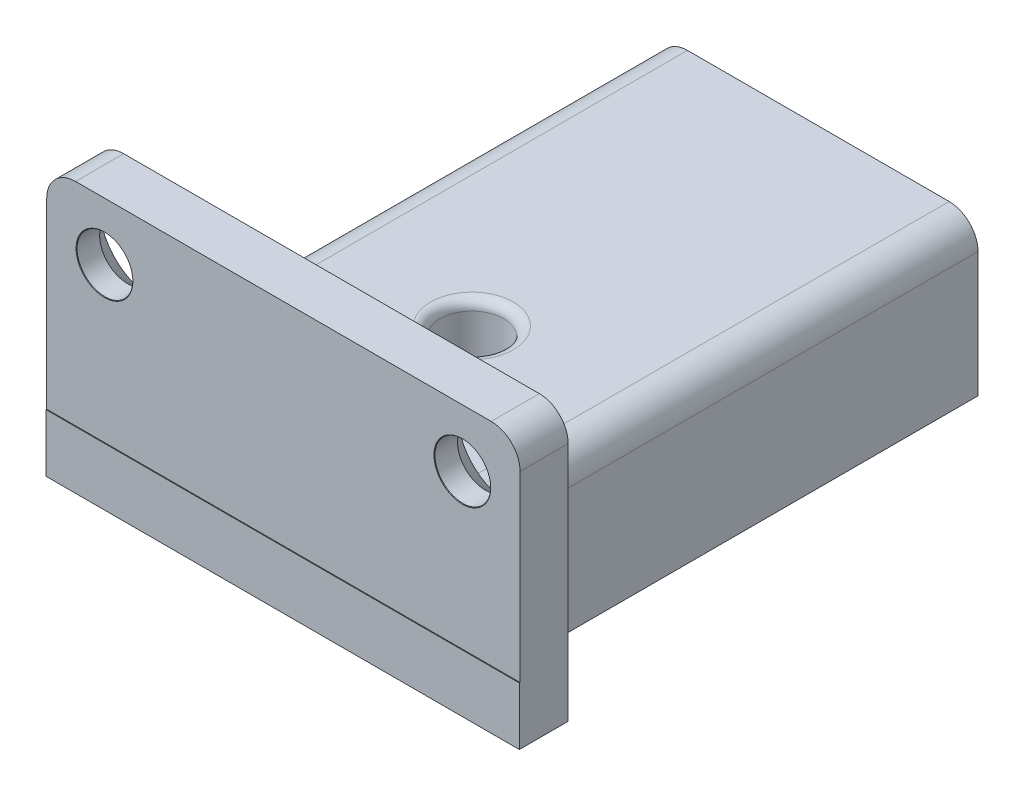
ISO-10303-21;
HEADER;
FILE_DESCRIPTION(('STEP AP214'),'2;1');
FILE_NAME('part.step','',(''),(''),'','','');
FILE_SCHEMA(('AUTOMOTIVE_DESIGN { 1 0 10303 214 1 1 1 1 }'));
ENDSEC;
DATA;
#1=APPLICATION_CONTEXT('core data for automotive mechanical design processes');
#2=APPLICATION_PROTOCOL_DEFINITION('international standard','automotive_design',2000,#1);
#3=PRODUCT_CONTEXT('',#1,'mechanical');
#4=PRODUCT('Part','Part','',(#3));
#5=PRODUCT_RELATED_PRODUCT_CATEGORY('part','',(#4));
#6=PRODUCT_DEFINITION_FORMATION('','',#4);
#7=PRODUCT_DEFINITION_CONTEXT('part definition',#1,'design');
#8=PRODUCT_DEFINITION('design','',#6,#7);
#9=PRODUCT_DEFINITION_SHAPE('','',#8);
#10=(LENGTH_UNIT() NAMED_UNIT(*) SI_UNIT(.MILLI.,.METRE.));
#11=(NAMED_UNIT(*) PLANE_ANGLE_UNIT() SI_UNIT($,.RADIAN.));
#12=(NAMED_UNIT(*) SI_UNIT($,.STERADIAN.) SOLID_ANGLE_UNIT());
#13=UNCERTAINTY_MEASURE_WITH_UNIT(LENGTH_MEASURE(1.E-05),#10,'distance_accuracy_value','');
#14=(GEOMETRIC_REPRESENTATION_CONTEXT(3) GLOBAL_UNCERTAINTY_ASSIGNED_CONTEXT((#13)) GLOBAL_UNIT_ASSIGNED_CONTEXT((#10,
#11,#12)) REPRESENTATION_CONTEXT('',''));
#15=CARTESIAN_POINT('',(0.,0.,0.));
#16=DIRECTION('',(0.,0.,1.));
#17=DIRECTION('',(1.,0.,0.));
#18=AXIS2_PLACEMENT_3D('',#15,#16,#17);
#19=CARTESIAN_POINT('',(-12.3,0.,5.33820224719101));
#20=DIRECTION('',(0.,0.,-1.));
#21=DIRECTION('',(-1.,0.,0.));
#22=AXIS2_PLACEMENT_3D('',#19,#20,#21);
#23=PLANE('',#22);
#24=DIRECTION('',(1.,0.,0.));
#25=VECTOR('',#24,1.);
#26=CARTESIAN_POINT('',(12.3,-3.,5.33820224719101));
#27=LINE('',#26,#25);
#28=CARTESIAN_POINT('',(-7.29999999999999,-3.,5.33820224719101));
#29=VERTEX_POINT('',#28);
#30=CARTESIAN_POINT('',(7.3,-3.,5.33820224719101));
#31=VERTEX_POINT('',#30);
#32=EDGE_CURVE('E273',#29,#31,#27,.T.);
#33=ORIENTED_EDGE('',*,*,#32,.F.);
#34=CARTESIAN_POINT('',(-7.3,-2.,5.33820224719101));
#35=DIRECTION('',(0.,0.,-1.));
#36=DIRECTION('',(-1.,0.,0.));
#37=AXIS2_PLACEMENT_3D('',#34,#35,#36);
#38=CIRCLE('',#37,1.);
#39=CARTESIAN_POINT('',(-6.3,-2.,5.33820224719101));
#40=VERTEX_POINT('',#39);
#41=EDGE_CURVE('E410',#29,#40,#38,.F.);
#42=ORIENTED_EDGE('',*,*,#41,.T.);
#43=DIRECTION('',(0.,-1.,0.));
#44=VECTOR('',#43,1.);
#45=CARTESIAN_POINT('',(-6.3,5.,5.33820224719101));
#46=LINE('',#45,#44);
#47=CARTESIAN_POINT('',(-6.3,0.,5.33820224719101));
#48=VERTEX_POINT('',#47);
#49=EDGE_CURVE('E240',#48,#40,#46,.T.);
#50=ORIENTED_EDGE('',*,*,#49,.F.);
#51=DIRECTION('',(1.,0.,0.));
#52=VECTOR('',#51,1.);
#53=CARTESIAN_POINT('',(12.3,0.,5.33820224719101));
#54=LINE('',#53,#52);
#55=CARTESIAN_POINT('',(6.3,0.,5.33820224719101));
#56=VERTEX_POINT('',#55);
#57=EDGE_CURVE('E266',#48,#56,#54,.T.);
#58=ORIENTED_EDGE('',*,*,#57,.T.);
#59=DIRECTION('',(0.,1.,0.));
#60=VECTOR('',#59,1.);
#61=CARTESIAN_POINT('',(6.3,5.,5.33820224719101));
#62=LINE('',#61,#60);
#63=CARTESIAN_POINT('',(6.3,-2.,5.33820224719101));
#64=VERTEX_POINT('',#63);
#65=EDGE_CURVE('E248',#64,#56,#62,.T.);
#66=ORIENTED_EDGE('',*,*,#65,.F.);
#67=CARTESIAN_POINT('',(7.3,-2.,5.33820224719101));
#68=DIRECTION('',(0.,0.,-1.));
#69=DIRECTION('',(-1.,0.,0.));
#70=AXIS2_PLACEMENT_3D('',#67,#68,#69);
#71=CIRCLE('',#70,1.);
#72=EDGE_CURVE('E412',#64,#31,#71,.F.);
#73=ORIENTED_EDGE('',*,*,#72,.T.);
#74=EDGE_LOOP('',(#33,#42,#50,#58,#66,#73));
#75=FACE_BOUND('',#74,.T.);
#76=ADVANCED_FACE('F36',(#75),#23,.T.);
#77=CARTESIAN_POINT('',(-9.3,8.,5.33820224719101));
#78=DIRECTION('',(0.,0.,-1.));
#79=DIRECTION('',(-1.,0.,0.));
#80=AXIS2_PLACEMENT_3D('',#77,#78,#79);
#81=CIRCLE('',#80,2.75);
#82=CARTESIAN_POINT('',(-12.05,8.,5.33820224719101));
#83=VERTEX_POINT('',#82);
#84=EDGE_CURVE('E308',#83,#83,#81,.T.);
#85=ORIENTED_EDGE('',*,*,#84,.F.);
#86=EDGE_LOOP('',(#85));
#87=FACE_BOUND('',#86,.T.);
#88=CARTESIAN_POINT('',(9.3,8.,5.33820224719101));
#89=DIRECTION('',(0.,0.,-1.));
#90=DIRECTION('',(-1.,0.,0.));
#91=AXIS2_PLACEMENT_3D('',#88,#89,#90);
#92=CIRCLE('',#91,2.75);
#93=CARTESIAN_POINT('',(6.55,8.,5.33820224719101));
#94=VERTEX_POINT('',#93);
#95=EDGE_CURVE('E320',#94,#94,#92,.T.);
#96=ORIENTED_EDGE('',*,*,#95,.F.);
#97=EDGE_LOOP('',(#96));
#98=FACE_BOUND('',#97,.T.);
#99=DIRECTION('',(-1.,0.,0.));
#100=VECTOR('',#99,1.);
#101=CARTESIAN_POINT('',(-12.3,11.,5.33820224719101));
#102=LINE('',#101,#100);
#103=CARTESIAN_POINT('',(10.8,11.,5.33820224719101));
#104=VERTEX_POINT('',#103);
#105=CARTESIAN_POINT('',(-10.8,11.,5.33820224719101));
#106=VERTEX_POINT('',#105);
#107=EDGE_CURVE('E332',#104,#106,#102,.T.);
#108=ORIENTED_EDGE('',*,*,#107,.F.);
#109=CARTESIAN_POINT('',(10.8,9.5,5.33820224719101));
#110=DIRECTION('',(0.,0.,-1.));
#111=DIRECTION('',(-1.,0.,0.));
#112=AXIS2_PLACEMENT_3D('',#109,#110,#111);
#113=CIRCLE('',#112,1.5);
#114=CARTESIAN_POINT('',(12.3,9.5,5.33820224719101));
#115=VERTEX_POINT('',#114);
#116=EDGE_CURVE('E440',#104,#115,#113,.T.);
#117=ORIENTED_EDGE('',*,*,#116,.T.);
#118=DIRECTION('',(0.,1.,0.));
#119=VECTOR('',#118,1.);
#120=CARTESIAN_POINT('',(12.3,0.,5.33820224719101));
#121=LINE('',#120,#119);
#122=CARTESIAN_POINT('',(12.3,-3.,5.33820224719101));
#123=VERTEX_POINT('',#122);
#124=EDGE_CURVE('E340',#123,#115,#121,.T.);
#125=ORIENTED_EDGE('',*,*,#124,.F.);
#126=CARTESIAN_POINT('',(8.3,-3.,5.33820224719101));
#127=VERTEX_POINT('',#126);
#128=EDGE_CURVE('E270',#127,#123,#27,.T.);
#129=ORIENTED_EDGE('',*,*,#128,.F.);
#130=DIRECTION('',(0.,-1.,0.));
#131=VECTOR('',#130,1.);
#132=CARTESIAN_POINT('',(8.3,5.,5.33820224719101));
#133=LINE('',#132,#131);
#134=CARTESIAN_POINT('',(8.3,3.5,5.33820224719101));
#135=VERTEX_POINT('',#134);
#136=EDGE_CURVE('E232',#135,#127,#133,.T.);
#137=ORIENTED_EDGE('',*,*,#136,.F.);
#138=CARTESIAN_POINT('',(6.8,3.5,5.33820224719101));
#139=DIRECTION('',(0.,0.,-1.));
#140=DIRECTION('',(-1.,0.,0.));
#141=AXIS2_PLACEMENT_3D('',#138,#139,#140);
#142=CIRCLE('',#141,1.5);
#143=CARTESIAN_POINT('',(6.8,5.,5.33820224719101));
#144=VERTEX_POINT('',#143);
#145=EDGE_CURVE('E430',#135,#144,#142,.F.);
#146=ORIENTED_EDGE('',*,*,#145,.T.);
#147=DIRECTION('',(-1.,0.,0.));
#148=VECTOR('',#147,1.);
#149=CARTESIAN_POINT('',(0.,5.,5.33820224719101));
#150=LINE('',#149,#148);
#151=CARTESIAN_POINT('',(-6.8,5.,5.33820224719101));
#152=VERTEX_POINT('',#151);
#153=EDGE_CURVE('E339',#144,#152,#150,.T.);
#154=ORIENTED_EDGE('',*,*,#153,.T.);
#155=CARTESIAN_POINT('',(-6.8,3.5,5.33820224719101));
#156=DIRECTION('',(0.,0.,-1.));
#157=DIRECTION('',(-1.,0.,0.));
#158=AXIS2_PLACEMENT_3D('',#155,#156,#157);
#159=CIRCLE('',#158,1.5);
#160=CARTESIAN_POINT('',(-8.3,3.5,5.33820224719101));
#161=VERTEX_POINT('',#160);
#162=EDGE_CURVE('E428',#152,#161,#159,.F.);
#163=ORIENTED_EDGE('',*,*,#162,.T.);
#164=DIRECTION('',(0.,1.,0.));
#165=VECTOR('',#164,1.);
#166=CARTESIAN_POINT('',(-8.3,5.,5.33820224719101));
#167=LINE('',#166,#165);
#168=CARTESIAN_POINT('',(-8.3,-3.,5.33820224719101));
#169=VERTEX_POINT('',#168);
#170=EDGE_CURVE('E239',#169,#161,#167,.T.);
#171=ORIENTED_EDGE('',*,*,#170,.F.);
#172=CARTESIAN_POINT('',(-12.3,-3.,5.33820224719101));
#173=VERTEX_POINT('',#172);
#174=EDGE_CURVE('E238',#173,#169,#27,.T.);
#175=ORIENTED_EDGE('',*,*,#174,.F.);
#176=DIRECTION('',(0.,1.,0.));
#177=VECTOR('',#176,1.);
#178=CARTESIAN_POINT('',(-12.3,0.,5.33820224719101));
#179=LINE('',#178,#177);
#180=CARTESIAN_POINT('',(-12.3,9.5,5.33820224719101));
#181=VERTEX_POINT('',#180);
#182=EDGE_CURVE('E336',#173,#181,#179,.T.);
#183=ORIENTED_EDGE('',*,*,#182,.T.);
#184=CARTESIAN_POINT('',(-10.8,9.5,5.33820224719101));
#185=DIRECTION('',(0.,0.,-1.));
#186=DIRECTION('',(-1.,0.,0.));
#187=AXIS2_PLACEMENT_3D('',#184,#185,#186);
#188=CIRCLE('',#187,1.5);
#189=EDGE_CURVE('E438',#181,#106,#188,.T.);
#190=ORIENTED_EDGE('',*,*,#189,.T.);
#191=EDGE_LOOP('',(#108,#117,#125,#129,#137,#146,#154,#163,#171,#175,#183,#190));
#192=FACE_BOUND('',#191,.T.);
#193=ADVANCED_FACE('F454',(#87,#98,#192),#23,.T.);
#194=CARTESIAN_POINT('',(0.,0.,0.));
#195=DIRECTION('',(0.,1.,0.));
#196=DIRECTION('',(0.,0.,1.));
#197=AXIS2_PLACEMENT_3D('',#194,#195,#196);
#198=PLANE('',#197);
#199=CARTESIAN_POINT('',(0.,0.,-1.96179775280899));
#200=DIRECTION('',(0.,1.,0.));
#201=DIRECTION('',(0.,0.,1.));
#202=AXIS2_PLACEMENT_3D('',#199,#200,#201);
#203=CIRCLE('',#202,2.15);
#204=CARTESIAN_POINT('',(0.,0.,0.188202247191008));
#205=VERTEX_POINT('',#204);
#206=EDGE_CURVE('E362',#205,#205,#203,.T.);
#207=ORIENTED_EDGE('',*,*,#206,.T.);
#208=EDGE_LOOP('',(#207));
#209=FACE_BOUND('',#208,.T.);
#210=ORIENTED_EDGE('',*,*,#57,.F.);
#211=DIRECTION('',(0.,0.,1.));
#212=VECTOR('',#211,1.);
#213=CARTESIAN_POINT('',(-6.3,0.,-4.96179775280899));
#214=LINE('',#213,#212);
#215=CARTESIAN_POINT('',(-6.3,0.,-4.96179775280899));
#216=VERTEX_POINT('',#215);
#217=EDGE_CURVE('E347',#216,#48,#214,.T.);
#218=ORIENTED_EDGE('',*,*,#217,.F.);
#219=DIRECTION('',(-1.,0.,0.));
#220=VECTOR('',#219,1.);
#221=CARTESIAN_POINT('',(-6.3,0.,-4.96179775280899));
#222=LINE('',#221,#220);
#223=CARTESIAN_POINT('',(6.3,0.,-4.96179775280899));
#224=VERTEX_POINT('',#223);
#225=EDGE_CURVE('E355',#224,#216,#222,.T.);
#226=ORIENTED_EDGE('',*,*,#225,.F.);
#227=DIRECTION('',(0.,0.,-1.));
#228=VECTOR('',#227,1.);
#229=CARTESIAN_POINT('',(6.3,0.,-4.96179775280899));
#230=LINE('',#229,#228);
#231=EDGE_CURVE('E352',#56,#224,#230,.T.);
#232=ORIENTED_EDGE('',*,*,#231,.F.);
#233=EDGE_LOOP('',(#210,#218,#226,#232));
#234=FACE_BOUND('',#233,.T.);
#235=ADVANCED_FACE('F492',(#209,#234),#198,.F.);
#236=CARTESIAN_POINT('',(-6.3,5.,-4.96179775280899));
#237=DIRECTION('',(0.,0.,1.));
#238=DIRECTION('',(1.,0.,0.));
#239=AXIS2_PLACEMENT_3D('',#236,#237,#238);
#240=PLANE('',#239);
#241=DIRECTION('',(0.,-1.,0.));
#242=VECTOR('',#241,1.);
#243=CARTESIAN_POINT('',(-6.3,5.,-4.96179775280899));
#244=LINE('',#243,#242);
#245=CARTESIAN_POINT('',(-6.3,1.,-4.96179775280899));
#246=VERTEX_POINT('',#245);
#247=EDGE_CURVE('E358',#246,#216,#244,.T.);
#248=ORIENTED_EDGE('',*,*,#247,.F.);
#249=DIRECTION('',(-1.,0.,0.));
#250=VECTOR('',#249,1.);
#251=CARTESIAN_POINT('',(6.3,0.999999999999998,-4.96179775280899));
#252=LINE('',#251,#250);
#253=CARTESIAN_POINT('',(6.3,0.999999999999998,-4.96179775280899));
#254=VERTEX_POINT('',#253);
#255=EDGE_CURVE('E390',#246,#254,#252,.F.);
#256=ORIENTED_EDGE('',*,*,#255,.T.);
#257=DIRECTION('',(0.,-1.,0.));
#258=VECTOR('',#257,1.);
#259=CARTESIAN_POINT('',(6.3,5.,-4.96179775280899));
#260=LINE('',#259,#258);
#261=EDGE_CURVE('E360',#254,#224,#260,.T.);
#262=ORIENTED_EDGE('',*,*,#261,.T.);
#263=ORIENTED_EDGE('',*,*,#225,.T.);
#264=EDGE_LOOP('',(#248,#256,#262,#263));
#265=FACE_BOUND('',#264,.T.);
#266=ADVANCED_FACE('F544',(#265),#240,.F.);
#267=CARTESIAN_POINT('',(0.,5.,0.));
#268=DIRECTION('',(0.,1.,0.));
#269=DIRECTION('',(0.,0.,1.));
#270=AXIS2_PLACEMENT_3D('',#267,#268,#269);
#271=PLANE('',#270);
#272=CARTESIAN_POINT('',(0.,5.,-1.96179775280899));
#273=DIRECTION('',(0.,1.,0.));
#274=DIRECTION('',(0.,0.,1.));
#275=AXIS2_PLACEMENT_3D('',#272,#273,#274);
#276=CIRCLE('',#275,2.15);
#277=CARTESIAN_POINT('',(0.,5.,0.188202247191008));
#278=VERTEX_POINT('',#277);
#279=EDGE_CURVE('E371',#278,#278,#276,.F.);
#280=ORIENTED_EDGE('',*,*,#279,.T.);
#281=EDGE_LOOP('',(#280));
#282=FACE_BOUND('',#281,.T.);
#283=DIRECTION('',(1.,0.,0.));
#284=VECTOR('',#283,1.);
#285=CARTESIAN_POINT('',(6.3,5.,-19.961797752809));
#286=LINE('',#285,#284);
#287=CARTESIAN_POINT('',(-6.8,5.,-19.961797752809));
#288=VERTEX_POINT('',#287);
#289=CARTESIAN_POINT('',(6.8,5.,-19.961797752809));
#290=VERTEX_POINT('',#289);
#291=EDGE_CURVE('E290',#288,#290,#286,.T.);
#292=ORIENTED_EDGE('',*,*,#291,.F.);
#293=DIRECTION('',(0.,0.,1.));
#294=VECTOR('',#293,1.);
#295=CARTESIAN_POINT('',(-6.8,5.,5.33820224719101));
#296=LINE('',#295,#294);
#297=EDGE_CURVE('E417',#288,#152,#296,.T.);
#298=ORIENTED_EDGE('',*,*,#297,.T.);
#299=ORIENTED_EDGE('',*,*,#153,.F.);
#300=DIRECTION('',(0.,0.,1.));
#301=VECTOR('',#300,1.);
#302=CARTESIAN_POINT('',(6.8,5.,-19.961797752809));
#303=LINE('',#302,#301);
#304=EDGE_CURVE('E415',#144,#290,#303,.F.);
#305=ORIENTED_EDGE('',*,*,#304,.T.);
#306=EDGE_LOOP('',(#292,#298,#299,#305));
#307=FACE_BOUND('',#306,.T.);
#308=ADVANCED_FACE('F541',(#282,#307),#271,.T.);
#309=CARTESIAN_POINT('',(-6.3,5.,7.83820224719101));
#310=DIRECTION('',(0.,0.,-1.));
#311=DIRECTION('',(-1.,0.,0.));
#312=AXIS2_PLACEMENT_3D('',#309,#310,#311);
#313=PLANE('',#312);
#314=CARTESIAN_POINT('',(-9.3,8.,7.83820224719101));
#315=DIRECTION('',(0.,0.,-1.));
#316=DIRECTION('',(-1.,0.,0.));
#317=AXIS2_PLACEMENT_3D('',#314,#315,#316);
#318=CIRCLE('',#317,1.475);
#319=CARTESIAN_POINT('',(-10.775,8.,7.83820224719101));
#320=VERTEX_POINT('',#319);
#321=EDGE_CURVE('E305',#320,#320,#318,.T.);
#322=ORIENTED_EDGE('',*,*,#321,.T.);
#323=EDGE_LOOP('',(#322));
#324=FACE_BOUND('',#323,.T.);
#325=CARTESIAN_POINT('',(9.3,8.,7.83820224719101));
#326=DIRECTION('',(0.,0.,-1.));
#327=DIRECTION('',(-1.,0.,0.));
#328=AXIS2_PLACEMENT_3D('',#325,#326,#327);
#329=CIRCLE('',#328,1.475);
#330=CARTESIAN_POINT('',(7.825,8.,7.83820224719101));
#331=VERTEX_POINT('',#330);
#332=EDGE_CURVE('E317',#331,#331,#329,.T.);
#333=ORIENTED_EDGE('',*,*,#332,.T.);
#334=EDGE_LOOP('',(#333));
#335=FACE_BOUND('',#334,.T.);
#336=DIRECTION('',(0.,1.,0.));
#337=VECTOR('',#336,1.);
#338=CARTESIAN_POINT('',(12.3,0.,7.83820224719101));
#339=LINE('',#338,#337);
#340=CARTESIAN_POINT('',(12.3,0.,7.83820224719101));
#341=VERTEX_POINT('',#340);
#342=CARTESIAN_POINT('',(12.3,9.5,7.83820224719101));
#343=VERTEX_POINT('',#342);
#344=EDGE_CURVE('E342',#341,#343,#339,.T.);
#345=ORIENTED_EDGE('',*,*,#344,.T.);
#346=CARTESIAN_POINT('',(10.8,9.5,7.83820224719101));
#347=DIRECTION('',(0.,0.,-1.));
#348=DIRECTION('',(-1.,0.,0.));
#349=AXIS2_PLACEMENT_3D('',#346,#347,#348);
#350=CIRCLE('',#349,1.5);
#351=CARTESIAN_POINT('',(10.8,11.,7.83820224719101));
#352=VERTEX_POINT('',#351);
#353=EDGE_CURVE('E44',#343,#352,#350,.F.);
#354=ORIENTED_EDGE('',*,*,#353,.T.);
#355=DIRECTION('',(1.,0.,0.));
#356=VECTOR('',#355,1.);
#357=CARTESIAN_POINT('',(-12.3,11.,7.83820224719101));
#358=LINE('',#357,#356);
#359=CARTESIAN_POINT('',(-10.8,11.,7.83820224719101));
#360=VERTEX_POINT('',#359);
#361=EDGE_CURVE('E329',#360,#352,#358,.T.);
#362=ORIENTED_EDGE('',*,*,#361,.F.);
#363=CARTESIAN_POINT('',(-10.8,9.5,7.83820224719101));
#364=DIRECTION('',(0.,0.,-1.));
#365=DIRECTION('',(-1.,0.,0.));
#366=AXIS2_PLACEMENT_3D('',#363,#364,#365);
#367=CIRCLE('',#366,1.5);
#368=CARTESIAN_POINT('',(-12.3,9.5,7.83820224719101));
#369=VERTEX_POINT('',#368);
#370=EDGE_CURVE('E51',#360,#369,#367,.F.);
#371=ORIENTED_EDGE('',*,*,#370,.T.);
#372=DIRECTION('',(0.,1.,0.));
#373=VECTOR('',#372,1.);
#374=CARTESIAN_POINT('',(-12.3,0.,7.83820224719101));
#375=LINE('',#374,#373);
#376=CARTESIAN_POINT('',(-12.3,0.,7.83820224719101));
#377=VERTEX_POINT('',#376);
#378=EDGE_CURVE('E335',#377,#369,#375,.T.);
#379=ORIENTED_EDGE('',*,*,#378,.F.);
#380=DIRECTION('',(1.,0.,0.));
#381=VECTOR('',#380,1.);
#382=CARTESIAN_POINT('',(-6.3,0.,7.83820224719101));
#383=LINE('',#382,#381);
#384=EDGE_CURVE('E349',#377,#341,#383,.T.);
#385=ORIENTED_EDGE('',*,*,#384,.T.);
#386=EDGE_LOOP('',(#345,#354,#362,#371,#379,#385));
#387=FACE_BOUND('',#386,.T.);
#388=ADVANCED_FACE('F444',(#324,#335,#387),#313,.F.);
#389=CARTESIAN_POINT('',(0.,5.,-1.96179775280899));
#390=DIRECTION('',(0.,-1.,0.));
#391=DIRECTION('',(0.,0.,-1.));
#392=AXIS2_PLACEMENT_3D('',#389,#390,#391);
#393=CYLINDRICAL_SURFACE('',#392,1.65);
#394=CARTESIAN_POINT('',(0.,0.5,-1.96179775280899));
#395=DIRECTION('',(0.,1.,0.));
#396=DIRECTION('',(0.,0.,1.));
#397=AXIS2_PLACEMENT_3D('',#394,#395,#396);
#398=CIRCLE('',#397,1.65);
#399=CARTESIAN_POINT('',(0.,0.5,-0.311797752808992));
#400=VERTEX_POINT('',#399);
#401=EDGE_CURVE('E368',#400,#400,#398,.F.);
#402=ORIENTED_EDGE('',*,*,#401,.T.);
#403=EDGE_LOOP('',(#402));
#404=FACE_BOUND('',#403,.T.);
#405=CARTESIAN_POINT('',(0.,4.5,-1.96179775280899));
#406=DIRECTION('',(0.,1.,0.));
#407=DIRECTION('',(0.,0.,1.));
#408=AXIS2_PLACEMENT_3D('',#405,#406,#407);
#409=CIRCLE('',#408,1.65);
#410=CARTESIAN_POINT('',(0.,4.5,-0.311797752808992));
#411=VERTEX_POINT('',#410);
#412=EDGE_CURVE('E365',#411,#411,#409,.T.);
#413=ORIENTED_EDGE('',*,*,#412,.T.);
#414=EDGE_LOOP('',(#413));
#415=FACE_BOUND('',#414,.T.);
#416=ADVANCED_FACE('F536',(#404,#415),#393,.F.);
#417=CARTESIAN_POINT('',(-12.3,0.,7.83820224719101));
#418=DIRECTION('',(-1.,0.,0.));
#419=DIRECTION('',(0.,0.,1.));
#420=AXIS2_PLACEMENT_3D('',#417,#418,#419);
#421=PLANE('',#420);
#422=ORIENTED_EDGE('',*,*,#378,.T.);
#423=DIRECTION('',(0.,0.,1.));
#424=VECTOR('',#423,1.);
#425=CARTESIAN_POINT('',(-12.3,9.5,5.33820224719101));
#426=LINE('',#425,#424);
#427=EDGE_CURVE('E11',#369,#181,#426,.F.);
#428=ORIENTED_EDGE('',*,*,#427,.T.);
#429=ORIENTED_EDGE('',*,*,#182,.F.);
#430=DIRECTION('',(0.,0.,-1.));
#431=VECTOR('',#430,1.);
#432=CARTESIAN_POINT('',(-12.3,-3.,5.33820224719101));
#433=LINE('',#432,#431);
#434=CARTESIAN_POINT('',(-12.3,-3.,7.87687080247679));
#435=VERTEX_POINT('',#434);
#436=EDGE_CURVE('E268',#435,#173,#433,.T.);
#437=ORIENTED_EDGE('',*,*,#436,.F.);
#438=DIRECTION('',(0.,1.,0.));
#439=VECTOR('',#438,1.);
#440=CARTESIAN_POINT('',(-12.3,-3.,7.87687080247679));
#441=LINE('',#440,#439);
#442=CARTESIAN_POINT('',(-12.3,0.,7.87687080247679));
#443=VERTEX_POINT('',#442);
#444=EDGE_CURVE('E272',#435,#443,#441,.T.);
#445=ORIENTED_EDGE('',*,*,#444,.T.);
#446=DIRECTION('',(0.,0.,-1.));
#447=VECTOR('',#446,1.);
#448=CARTESIAN_POINT('',(-12.3,0.,5.33820224719101));
#449=LINE('',#448,#447);
#450=EDGE_CURVE('E277',#443,#377,#449,.T.);
#451=ORIENTED_EDGE('',*,*,#450,.T.);
#452=EDGE_LOOP('',(#422,#428,#429,#437,#445,#451));
#453=FACE_BOUND('',#452,.T.);
#454=ADVANCED_FACE('F533',(#453),#421,.T.);
#455=CARTESIAN_POINT('',(12.3,0.,7.83820224719101));
#456=DIRECTION('',(1.,0.,0.));
#457=DIRECTION('',(0.,0.,-1.));
#458=AXIS2_PLACEMENT_3D('',#455,#456,#457);
#459=PLANE('',#458);
#460=ORIENTED_EDGE('',*,*,#124,.T.);
#461=DIRECTION('',(0.,0.,-1.));
#462=VECTOR('',#461,1.);
#463=CARTESIAN_POINT('',(12.3,9.5,7.83820224719101));
#464=LINE('',#463,#462);
#465=EDGE_CURVE('E59',#115,#343,#464,.F.);
#466=ORIENTED_EDGE('',*,*,#465,.T.);
#467=ORIENTED_EDGE('',*,*,#344,.F.);
#468=DIRECTION('',(0.,0.,1.));
#469=VECTOR('',#468,1.);
#470=CARTESIAN_POINT('',(12.3,0.,5.33820224719101));
#471=LINE('',#470,#469);
#472=CARTESIAN_POINT('',(12.3,0.,7.87687080247679));
#473=VERTEX_POINT('',#472);
#474=EDGE_CURVE('E256',#341,#473,#471,.T.);
#475=ORIENTED_EDGE('',*,*,#474,.T.);
#476=DIRECTION('',(0.,1.,0.));
#477=VECTOR('',#476,1.);
#478=CARTESIAN_POINT('',(12.3,-3.,7.87687080247679));
#479=LINE('',#478,#477);
#480=CARTESIAN_POINT('',(12.3,-3.,7.87687080247679));
#481=VERTEX_POINT('',#480);
#482=EDGE_CURVE('E284',#481,#473,#479,.T.);
#483=ORIENTED_EDGE('',*,*,#482,.F.);
#484=DIRECTION('',(0.,0.,1.));
#485=VECTOR('',#484,1.);
#486=CARTESIAN_POINT('',(12.3,-3.,5.33820224719101));
#487=LINE('',#486,#485);
#488=EDGE_CURVE('E262',#123,#481,#487,.T.);
#489=ORIENTED_EDGE('',*,*,#488,.F.);
#490=EDGE_LOOP('',(#460,#466,#467,#475,#483,#489));
#491=FACE_BOUND('',#490,.T.);
#492=ADVANCED_FACE('F457',(#491),#459,.T.);
#493=CARTESIAN_POINT('',(0.,11.,0.));
#494=DIRECTION('',(0.,-1.,0.));
#495=DIRECTION('',(0.,0.,-1.));
#496=AXIS2_PLACEMENT_3D('',#493,#494,#495);
#497=PLANE('',#496);
#498=ORIENTED_EDGE('',*,*,#361,.T.);
#499=DIRECTION('',(0.,0.,-1.));
#500=VECTOR('',#499,1.);
#501=CARTESIAN_POINT('',(10.8,11.,5.33820224719101));
#502=LINE('',#501,#500);
#503=EDGE_CURVE('E435',#352,#104,#502,.T.);
#504=ORIENTED_EDGE('',*,*,#503,.T.);
#505=ORIENTED_EDGE('',*,*,#107,.T.);
#506=DIRECTION('',(0.,0.,1.));
#507=VECTOR('',#506,1.);
#508=CARTESIAN_POINT('',(-10.8,11.,7.83820224719101));
#509=LINE('',#508,#507);
#510=EDGE_CURVE('E432',#106,#360,#509,.T.);
#511=ORIENTED_EDGE('',*,*,#510,.T.);
#512=EDGE_LOOP('',(#498,#504,#505,#511));
#513=FACE_BOUND('',#512,.T.);
#514=ADVANCED_FACE('F448',(#513),#497,.F.);
#515=CARTESIAN_POINT('',(9.3,8.,7.813202247191));
#516=DIRECTION('',(0.,0.,1.));
#517=DIRECTION('',(1.,0.,0.));
#518=AXIS2_PLACEMENT_3D('',#515,#516,#517);
#519=CONICAL_SURFACE('',#518,1.45,0.785398163397414);
#520=ORIENTED_EDGE('',*,*,#332,.F.);
#521=EDGE_LOOP('',(#520));
#522=FACE_BOUND('',#521,.T.);
#523=CARTESIAN_POINT('',(9.3,8.,7.813202247191));
#524=DIRECTION('',(0.,0.,-1.));
#525=DIRECTION('',(-1.,0.,0.));
#526=AXIS2_PLACEMENT_3D('',#523,#524,#525);
#527=CIRCLE('',#526,1.45);
#528=CARTESIAN_POINT('',(7.85,8.,7.813202247191));
#529=VERTEX_POINT('',#528);
#530=EDGE_CURVE('E326',#529,#529,#527,.T.);
#531=ORIENTED_EDGE('',*,*,#530,.T.);
#532=EDGE_LOOP('',(#531));
#533=FACE_BOUND('',#532,.T.);
#534=ADVANCED_FACE('F623',(#522,#533),#519,.F.);
#535=CARTESIAN_POINT('',(9.3,8.,5.33820224719101));
#536=DIRECTION('',(0.,0.,-1.));
#537=DIRECTION('',(-1.,0.,0.));
#538=AXIS2_PLACEMENT_3D('',#535,#536,#537);
#539=CYLINDRICAL_SURFACE('',#538,1.45);
#540=ORIENTED_EDGE('',*,*,#530,.F.);
#541=EDGE_LOOP('',(#540));
#542=FACE_BOUND('',#541,.T.);
#543=CARTESIAN_POINT('',(9.3,8.,6.63820224719101));
#544=DIRECTION('',(0.,0.,-1.));
#545=DIRECTION('',(-1.,0.,0.));
#546=AXIS2_PLACEMENT_3D('',#543,#544,#545);
#547=CIRCLE('',#546,1.45);
#548=CARTESIAN_POINT('',(7.85,8.,6.63820224719101));
#549=VERTEX_POINT('',#548);
#550=EDGE_CURVE('E323',#549,#549,#547,.T.);
#551=ORIENTED_EDGE('',*,*,#550,.T.);
#552=EDGE_LOOP('',(#551));
#553=FACE_BOUND('',#552,.T.);
#554=ADVANCED_FACE('F620',(#542,#553),#539,.F.);
#555=CARTESIAN_POINT('',(9.3,8.,5.33820224719101));
#556=DIRECTION('',(0.,0.,-1.));
#557=DIRECTION('',(-1.,0.,0.));
#558=AXIS2_PLACEMENT_3D('',#555,#556,#557);
#559=CONICAL_SURFACE('',#558,2.75,0.785398163397448);
#560=ORIENTED_EDGE('',*,*,#550,.F.);
#561=EDGE_LOOP('',(#560));
#562=FACE_BOUND('',#561,.T.);
#563=ORIENTED_EDGE('',*,*,#95,.T.);
#564=EDGE_LOOP('',(#563));
#565=FACE_BOUND('',#564,.T.);
#566=ADVANCED_FACE('F616',(#562,#565),#559,.F.);
#567=CARTESIAN_POINT('',(-9.3,8.,7.813202247191));
#568=DIRECTION('',(0.,0.,1.));
#569=DIRECTION('',(1.,0.,0.));
#570=AXIS2_PLACEMENT_3D('',#567,#568,#569);
#571=CONICAL_SURFACE('',#570,1.45,0.785398163397414);
#572=ORIENTED_EDGE('',*,*,#321,.F.);
#573=EDGE_LOOP('',(#572));
#574=FACE_BOUND('',#573,.T.);
#575=CARTESIAN_POINT('',(-9.3,8.,7.813202247191));
#576=DIRECTION('',(0.,0.,-1.));
#577=DIRECTION('',(-1.,0.,0.));
#578=AXIS2_PLACEMENT_3D('',#575,#576,#577);
#579=CIRCLE('',#578,1.45);
#580=CARTESIAN_POINT('',(-10.75,8.,7.813202247191));
#581=VERTEX_POINT('',#580);
#582=EDGE_CURVE('E314',#581,#581,#579,.T.);
#583=ORIENTED_EDGE('',*,*,#582,.T.);
#584=EDGE_LOOP('',(#583));
#585=FACE_BOUND('',#584,.T.);
#586=ADVANCED_FACE('F612',(#574,#585),#571,.F.);
#587=CARTESIAN_POINT('',(-9.3,8.,5.33820224719101));
#588=DIRECTION('',(0.,0.,-1.));
#589=DIRECTION('',(-1.,0.,0.));
#590=AXIS2_PLACEMENT_3D('',#587,#588,#589);
#591=CYLINDRICAL_SURFACE('',#590,1.45);
#592=ORIENTED_EDGE('',*,*,#582,.F.);
#593=EDGE_LOOP('',(#592));
#594=FACE_BOUND('',#593,.T.);
#595=CARTESIAN_POINT('',(-9.3,8.,6.63820224719101));
#596=DIRECTION('',(0.,0.,-1.));
#597=DIRECTION('',(-1.,0.,0.));
#598=AXIS2_PLACEMENT_3D('',#595,#596,#597);
#599=CIRCLE('',#598,1.45);
#600=CARTESIAN_POINT('',(-10.75,8.,6.63820224719101));
#601=VERTEX_POINT('',#600);
#602=EDGE_CURVE('E311',#601,#601,#599,.T.);
#603=ORIENTED_EDGE('',*,*,#602,.T.);
#604=EDGE_LOOP('',(#603));
#605=FACE_BOUND('',#604,.T.);
#606=ADVANCED_FACE('F608',(#594,#605),#591,.F.);
#607=CARTESIAN_POINT('',(-9.3,8.,5.33820224719101));
#608=DIRECTION('',(0.,0.,-1.));
#609=DIRECTION('',(-1.,0.,0.));
#610=AXIS2_PLACEMENT_3D('',#607,#608,#609);
#611=CONICAL_SURFACE('',#610,2.75,0.785398163397448);
#612=ORIENTED_EDGE('',*,*,#602,.F.);
#613=EDGE_LOOP('',(#612));
#614=FACE_BOUND('',#613,.T.);
#615=ORIENTED_EDGE('',*,*,#84,.T.);
#616=EDGE_LOOP('',(#615));
#617=FACE_BOUND('',#616,.T.);
#618=ADVANCED_FACE('F557',(#614,#617),#611,.F.);
#619=CARTESIAN_POINT('',(0.,0.5,-1.96179775280899));
#620=DIRECTION('',(0.,1.,0.));
#621=DIRECTION('',(0.,0.,1.));
#622=AXIS2_PLACEMENT_3D('',#619,#620,#621);
#623=TOROIDAL_SURFACE('',#622,2.15,0.5);
#624=ORIENTED_EDGE('',*,*,#401,.F.);
#625=EDGE_LOOP('',(#624));
#626=FACE_BOUND('',#625,.T.);
#627=ORIENTED_EDGE('',*,*,#206,.F.);
#628=EDGE_LOOP('',(#627));
#629=FACE_BOUND('',#628,.T.);
#630=ADVANCED_FACE('F554',(#626,#629),#623,.T.);
#631=CARTESIAN_POINT('',(0.,4.5,-1.96179775280899));
#632=DIRECTION('',(0.,1.,0.));
#633=DIRECTION('',(0.,0.,1.));
#634=AXIS2_PLACEMENT_3D('',#631,#632,#633);
#635=TOROIDAL_SURFACE('',#634,2.15,0.5);
#636=ORIENTED_EDGE('',*,*,#279,.F.);
#637=EDGE_LOOP('',(#636));
#638=FACE_BOUND('',#637,.T.);
#639=ORIENTED_EDGE('',*,*,#412,.F.);
#640=EDGE_LOOP('',(#639));
#641=FACE_BOUND('',#640,.T.);
#642=ADVANCED_FACE('F556',(#638,#641),#635,.T.);
#643=CARTESIAN_POINT('',(-6.3,2.,-14.961797752809));
#644=DIRECTION('',(0.,1.,0.));
#645=DIRECTION('',(-1.,0.,0.));
#646=AXIS2_PLACEMENT_3D('',#643,#644,#645);
#647=PLANE('',#646);
#648=DIRECTION('',(0.,0.,1.));
#649=VECTOR('',#648,1.);
#650=CARTESIAN_POINT('',(-6.3,2.,-14.961797752809));
#651=LINE('',#650,#649);
#652=CARTESIAN_POINT('',(-6.3,2.,-13.961797752809));
#653=VERTEX_POINT('',#652);
#654=CARTESIAN_POINT('',(-6.3,2.,-5.96179775280899));
#655=VERTEX_POINT('',#654);
#656=EDGE_CURVE('E299',#653,#655,#651,.T.);
#657=ORIENTED_EDGE('',*,*,#656,.F.);
#658=DIRECTION('',(-1.,0.,0.));
#659=VECTOR('',#658,1.);
#660=CARTESIAN_POINT('',(6.3,2.,-13.961797752809));
#661=LINE('',#660,#659);
#662=CARTESIAN_POINT('',(6.3,2.,-13.961797752809));
#663=VERTEX_POINT('',#662);
#664=EDGE_CURVE('E384',#653,#663,#661,.F.);
#665=ORIENTED_EDGE('',*,*,#664,.T.);
#666=DIRECTION('',(0.,0.,1.));
#667=VECTOR('',#666,1.);
#668=CARTESIAN_POINT('',(6.3,2.,-14.961797752809));
#669=LINE('',#668,#667);
#670=CARTESIAN_POINT('',(6.3,2.,-5.96179775280899));
#671=VERTEX_POINT('',#670);
#672=EDGE_CURVE('E302',#663,#671,#669,.T.);
#673=ORIENTED_EDGE('',*,*,#672,.T.);
#674=DIRECTION('',(-1.,0.,0.));
#675=VECTOR('',#674,1.);
#676=CARTESIAN_POINT('',(-6.3,2.,-5.96179775280899));
#677=LINE('',#676,#675);
#678=EDGE_CURVE('E381',#671,#655,#677,.T.);
#679=ORIENTED_EDGE('',*,*,#678,.T.);
#680=EDGE_LOOP('',(#657,#665,#673,#679));
#681=FACE_BOUND('',#680,.T.);
#682=ADVANCED_FACE('F504',(#681),#647,.F.);
#683=CARTESIAN_POINT('',(6.3,0.,-19.961797752809));
#684=DIRECTION('',(0.,1.,0.));
#685=DIRECTION('',(0.,0.,1.));
#686=AXIS2_PLACEMENT_3D('',#683,#684,#685);
#687=PLANE('',#686);
#688=DIRECTION('',(0.,0.,1.));
#689=VECTOR('',#688,1.);
#690=CARTESIAN_POINT('',(6.3,0.,-19.961797752809));
#691=LINE('',#690,#689);
#692=CARTESIAN_POINT('',(6.3,0.,-19.961797752809));
#693=VERTEX_POINT('',#692);
#694=CARTESIAN_POINT('',(6.3,0.,-15.961797752809));
#695=VERTEX_POINT('',#694);
#696=EDGE_CURVE('E296',#693,#695,#691,.T.);
#697=ORIENTED_EDGE('',*,*,#696,.T.);
#698=DIRECTION('',(-1.,0.,0.));
#699=VECTOR('',#698,1.);
#700=CARTESIAN_POINT('',(6.3,0.,-15.961797752809));
#701=LINE('',#700,#699);
#702=CARTESIAN_POINT('',(-6.3,0.,-15.961797752809));
#703=VERTEX_POINT('',#702);
#704=EDGE_CURVE('E374',#695,#703,#701,.T.);
#705=ORIENTED_EDGE('',*,*,#704,.T.);
#706=DIRECTION('',(0.,0.,1.));
#707=VECTOR('',#706,1.);
#708=CARTESIAN_POINT('',(-6.3,0.,-19.961797752809));
#709=LINE('',#708,#707);
#710=CARTESIAN_POINT('',(-6.3,0.,-19.961797752809));
#711=VERTEX_POINT('',#710);
#712=EDGE_CURVE('E293',#711,#703,#709,.T.);
#713=ORIENTED_EDGE('',*,*,#712,.F.);
#714=DIRECTION('',(-1.,0.,0.));
#715=VECTOR('',#714,1.);
#716=CARTESIAN_POINT('',(6.3,0.,-19.961797752809));
#717=LINE('',#716,#715);
#718=EDGE_CURVE('E287',#693,#711,#717,.T.);
#719=ORIENTED_EDGE('',*,*,#718,.F.);
#720=EDGE_LOOP('',(#697,#705,#713,#719));
#721=FACE_BOUND('',#720,.T.);
#722=ADVANCED_FACE('F480',(#721),#687,.F.);
#723=CARTESIAN_POINT('',(0.,0.,-19.961797752809));
#724=DIRECTION('',(0.,0.,-1.));
#725=DIRECTION('',(-1.,0.,0.));
#726=AXIS2_PLACEMENT_3D('',#723,#724,#725);
#727=PLANE('',#726);
#728=DIRECTION('',(0.,1.,0.));
#729=VECTOR('',#728,1.);
#730=CARTESIAN_POINT('',(-8.3,5.,-19.961797752809));
#731=LINE('',#730,#729);
#732=CARTESIAN_POINT('',(-8.3,-3.,-19.961797752809));
#733=VERTEX_POINT('',#732);
#734=CARTESIAN_POINT('',(-8.3,3.5,-19.961797752809));
#735=VERTEX_POINT('',#734);
#736=EDGE_CURVE('E214',#733,#735,#731,.T.);
#737=ORIENTED_EDGE('',*,*,#736,.T.);
#738=CARTESIAN_POINT('',(-6.8,3.5,-19.961797752809));
#739=DIRECTION('',(0.,0.,-1.));
#740=DIRECTION('',(-1.,0.,0.));
#741=AXIS2_PLACEMENT_3D('',#738,#739,#740);
#742=CIRCLE('',#741,1.5);
#743=EDGE_CURVE('E423',#735,#288,#742,.T.);
#744=ORIENTED_EDGE('',*,*,#743,.T.);
#745=ORIENTED_EDGE('',*,*,#291,.T.);
#746=CARTESIAN_POINT('',(6.8,3.5,-19.961797752809));
#747=DIRECTION('',(0.,0.,-1.));
#748=DIRECTION('',(-1.,0.,0.));
#749=AXIS2_PLACEMENT_3D('',#746,#747,#748);
#750=CIRCLE('',#749,1.5);
#751=CARTESIAN_POINT('',(8.3,3.5,-19.961797752809));
#752=VERTEX_POINT('',#751);
#753=EDGE_CURVE('E421',#290,#752,#750,.T.);
#754=ORIENTED_EDGE('',*,*,#753,.T.);
#755=DIRECTION('',(0.,-1.,0.));
#756=VECTOR('',#755,1.);
#757=CARTESIAN_POINT('',(8.3,5.,-19.961797752809));
#758=LINE('',#757,#756);
#759=CARTESIAN_POINT('',(8.3,-3.,-19.961797752809));
#760=VERTEX_POINT('',#759);
#761=EDGE_CURVE('E257',#752,#760,#758,.T.);
#762=ORIENTED_EDGE('',*,*,#761,.T.);
#763=DIRECTION('',(-1.,0.,0.));
#764=VECTOR('',#763,1.);
#765=CARTESIAN_POINT('',(6.3,-3.,-19.961797752809));
#766=LINE('',#765,#764);
#767=CARTESIAN_POINT('',(7.3,-3.,-19.961797752809));
#768=VERTEX_POINT('',#767);
#769=EDGE_CURVE('E253',#760,#768,#766,.T.);
#770=ORIENTED_EDGE('',*,*,#769,.T.);
#771=CARTESIAN_POINT('',(7.3,-2.,-19.961797752809));
#772=DIRECTION('',(0.,0.,-1.));
#773=DIRECTION('',(-1.,0.,0.));
#774=AXIS2_PLACEMENT_3D('',#771,#772,#773);
#775=CIRCLE('',#774,1.);
#776=CARTESIAN_POINT('',(6.3,-2.,-19.961797752809));
#777=VERTEX_POINT('',#776);
#778=EDGE_CURVE('E404',#768,#777,#775,.T.);
#779=ORIENTED_EDGE('',*,*,#778,.T.);
#780=DIRECTION('',(0.,1.,0.));
#781=VECTOR('',#780,1.);
#782=CARTESIAN_POINT('',(6.3,5.,-19.961797752809));
#783=LINE('',#782,#781);
#784=EDGE_CURVE('E250',#777,#693,#783,.T.);
#785=ORIENTED_EDGE('',*,*,#784,.T.);
#786=ORIENTED_EDGE('',*,*,#718,.T.);
#787=DIRECTION('',(0.,-1.,0.));
#788=VECTOR('',#787,1.);
#789=CARTESIAN_POINT('',(-6.3,5.,-19.961797752809));
#790=LINE('',#789,#788);
#791=CARTESIAN_POINT('',(-6.3,-2.,-19.961797752809));
#792=VERTEX_POINT('',#791);
#793=EDGE_CURVE('E223',#711,#792,#790,.T.);
#794=ORIENTED_EDGE('',*,*,#793,.T.);
#795=CARTESIAN_POINT('',(-7.3,-2.,-19.961797752809));
#796=DIRECTION('',(0.,0.,-1.));
#797=DIRECTION('',(-1.,0.,0.));
#798=AXIS2_PLACEMENT_3D('',#795,#796,#797);
#799=CIRCLE('',#798,1.);
#800=CARTESIAN_POINT('',(-7.3,-3.,-19.961797752809));
#801=VERTEX_POINT('',#800);
#802=EDGE_CURVE('E218',#792,#801,#799,.T.);
#803=ORIENTED_EDGE('',*,*,#802,.T.);
#804=DIRECTION('',(-1.,0.,0.));
#805=VECTOR('',#804,1.);
#806=CARTESIAN_POINT('',(-6.3,-3.,-19.961797752809));
#807=LINE('',#806,#805);
#808=EDGE_CURVE('E211',#801,#733,#807,.T.);
#809=ORIENTED_EDGE('',*,*,#808,.T.);
#810=EDGE_LOOP('',(#737,#744,#745,#754,#762,#770,#779,#785,#786,#794,#803,#809));
#811=FACE_BOUND('',#810,.T.);
#812=ADVANCED_FACE('F213',(#811),#727,.T.);
#813=CARTESIAN_POINT('',(0.,0.,0.));
#814=DIRECTION('',(0.,-1.,0.));
#815=DIRECTION('',(0.,0.,-1.));
#816=AXIS2_PLACEMENT_3D('',#813,#814,#815);
#817=PLANE('',#816);
#818=ORIENTED_EDGE('',*,*,#474,.F.);
#819=ORIENTED_EDGE('',*,*,#384,.F.);
#820=ORIENTED_EDGE('',*,*,#450,.F.);
#821=DIRECTION('',(-1.,0.,0.));
#822=VECTOR('',#821,1.);
#823=CARTESIAN_POINT('',(12.3,0.,7.87687080247679));
#824=LINE('',#823,#822);
#825=EDGE_CURVE('E275',#473,#443,#824,.T.);
#826=ORIENTED_EDGE('',*,*,#825,.F.);
#827=EDGE_LOOP('',(#818,#819,#820,#826));
#828=FACE_BOUND('',#827,.T.);
#829=ADVANCED_FACE('F595',(#828),#817,.F.);
#830=CARTESIAN_POINT('',(12.3,-3.,7.87687080247679));
#831=DIRECTION('',(0.,0.,-1.));
#832=DIRECTION('',(-1.,0.,0.));
#833=AXIS2_PLACEMENT_3D('',#830,#831,#832);
#834=PLANE('',#833);
#835=ORIENTED_EDGE('',*,*,#825,.T.);
#836=ORIENTED_EDGE('',*,*,#444,.F.);
#837=DIRECTION('',(-1.,0.,0.));
#838=VECTOR('',#837,1.);
#839=CARTESIAN_POINT('',(12.3,-3.,7.87687080247679));
#840=LINE('',#839,#838);
#841=EDGE_CURVE('E265',#481,#435,#840,.T.);
#842=ORIENTED_EDGE('',*,*,#841,.F.);
#843=ORIENTED_EDGE('',*,*,#482,.T.);
#844=EDGE_LOOP('',(#835,#836,#842,#843));
#845=FACE_BOUND('',#844,.T.);
#846=ADVANCED_FACE('F594',(#845),#834,.F.);
#847=CARTESIAN_POINT('',(0.,-3.,0.));
#848=DIRECTION('',(0.,-1.,0.));
#849=DIRECTION('',(0.,0.,-1.));
#850=AXIS2_PLACEMENT_3D('',#847,#848,#849);
#851=PLANE('',#850);
#852=ORIENTED_EDGE('',*,*,#808,.F.);
#853=DIRECTION('',(0.,0.,1.));
#854=VECTOR('',#853,1.);
#855=CARTESIAN_POINT('',(-7.3,-3.,5.33820224719101));
#856=LINE('',#855,#854);
#857=EDGE_CURVE('E400',#801,#29,#856,.T.);
#858=ORIENTED_EDGE('',*,*,#857,.T.);
#859=ORIENTED_EDGE('',*,*,#32,.T.);
#860=DIRECTION('',(0.,0.,1.));
#861=VECTOR('',#860,1.);
#862=CARTESIAN_POINT('',(7.3,-3.,-19.961797752809));
#863=LINE('',#862,#861);
#864=EDGE_CURVE('E396',#31,#768,#863,.F.);
#865=ORIENTED_EDGE('',*,*,#864,.T.);
#866=ORIENTED_EDGE('',*,*,#769,.F.);
#867=DIRECTION('',(0.,0.,1.));
#868=VECTOR('',#867,1.);
#869=CARTESIAN_POINT('',(8.3,-3.,-28.2080090040443));
#870=LINE('',#869,#868);
#871=EDGE_CURVE('E251',#760,#127,#870,.T.);
#872=ORIENTED_EDGE('',*,*,#871,.T.);
#873=ORIENTED_EDGE('',*,*,#128,.T.);
#874=ORIENTED_EDGE('',*,*,#488,.T.);
#875=ORIENTED_EDGE('',*,*,#841,.T.);
#876=ORIENTED_EDGE('',*,*,#436,.T.);
#877=ORIENTED_EDGE('',*,*,#174,.T.);
#878=DIRECTION('',(0.,0.,1.));
#879=VECTOR('',#878,1.);
#880=CARTESIAN_POINT('',(-8.3,-3.,-28.2080090040443));
#881=LINE('',#880,#879);
#882=EDGE_CURVE('E228',#733,#169,#881,.T.);
#883=ORIENTED_EDGE('',*,*,#882,.F.);
#884=EDGE_LOOP('',(#852,#858,#859,#865,#866,#872,#873,#874,#875,#876,#877,#883));
#885=FACE_BOUND('',#884,.T.);
#886=ADVANCED_FACE('F235',(#885),#851,.T.);
#887=CARTESIAN_POINT('',(6.3,5.,-28.2080090040443));
#888=DIRECTION('',(1.,0.,0.));
#889=DIRECTION('',(0.,1.,0.));
#890=AXIS2_PLACEMENT_3D('',#887,#888,#889);
#891=PLANE('',#890);
#892=ORIENTED_EDGE('',*,*,#784,.F.);
#893=DIRECTION('',(0.,0.,1.));
#894=VECTOR('',#893,1.);
#895=CARTESIAN_POINT('',(6.3,-2.,5.33820224719101));
#896=LINE('',#895,#894);
#897=EDGE_CURVE('E407',#777,#64,#896,.T.);
#898=ORIENTED_EDGE('',*,*,#897,.T.);
#899=ORIENTED_EDGE('',*,*,#65,.T.);
#900=ORIENTED_EDGE('',*,*,#231,.T.);
#901=ORIENTED_EDGE('',*,*,#261,.F.);
#902=CARTESIAN_POINT('',(6.3,0.999999999999998,-5.96179775280899));
#903=DIRECTION('',(1.,0.,0.));
#904=DIRECTION('',(0.,1.,0.));
#905=AXIS2_PLACEMENT_3D('',#902,#903,#904);
#906=CIRCLE('',#905,1.);
#907=EDGE_CURVE('E386',#254,#671,#906,.F.);
#908=ORIENTED_EDGE('',*,*,#907,.T.);
#909=ORIENTED_EDGE('',*,*,#672,.F.);
#910=CARTESIAN_POINT('',(6.3,0.999999999999998,-13.961797752809));
#911=DIRECTION('',(1.,0.,0.));
#912=DIRECTION('',(0.,1.,0.));
#913=AXIS2_PLACEMENT_3D('',#910,#911,#912);
#914=CIRCLE('',#913,1.);
#915=CARTESIAN_POINT('',(6.3,0.999999999999998,-14.961797752809));
#916=VERTEX_POINT('',#915);
#917=EDGE_CURVE('E388',#663,#916,#914,.F.);
#918=ORIENTED_EDGE('',*,*,#917,.T.);
#919=CARTESIAN_POINT('',(6.3,1.,-15.961797752809));
#920=DIRECTION('',(1.,0.,0.));
#921=DIRECTION('',(0.,1.,0.));
#922=AXIS2_PLACEMENT_3D('',#919,#920,#921);
#923=CIRCLE('',#922,1.);
#924=EDGE_CURVE('E394',#916,#695,#923,.T.);
#925=ORIENTED_EDGE('',*,*,#924,.T.);
#926=ORIENTED_EDGE('',*,*,#696,.F.);
#927=EDGE_LOOP('',(#892,#898,#899,#900,#901,#908,#909,#918,#925,#926));
#928=FACE_BOUND('',#927,.T.);
#929=ADVANCED_FACE('F474',(#928),#891,.F.);
#930=CARTESIAN_POINT('',(8.3,5.,-28.2080090040443));
#931=DIRECTION('',(-1.,0.,0.));
#932=DIRECTION('',(0.,0.,1.));
#933=AXIS2_PLACEMENT_3D('',#930,#931,#932);
#934=PLANE('',#933);
#935=ORIENTED_EDGE('',*,*,#761,.F.);
#936=DIRECTION('',(0.,0.,1.));
#937=VECTOR('',#936,1.);
#938=CARTESIAN_POINT('',(8.3,3.5,5.33820224719101));
#939=LINE('',#938,#937);
#940=EDGE_CURVE('E425',#752,#135,#939,.T.);
#941=ORIENTED_EDGE('',*,*,#940,.T.);
#942=ORIENTED_EDGE('',*,*,#136,.T.);
#943=ORIENTED_EDGE('',*,*,#871,.F.);
#944=EDGE_LOOP('',(#935,#941,#942,#943));
#945=FACE_BOUND('',#944,.T.);
#946=ADVANCED_FACE('F582',(#945),#934,.F.);
#947=CARTESIAN_POINT('',(-6.3,5.,-28.2080090040443));
#948=DIRECTION('',(-1.,0.,0.));
#949=DIRECTION('',(0.,-1.,0.));
#950=AXIS2_PLACEMENT_3D('',#947,#948,#949);
#951=PLANE('',#950);
#952=ORIENTED_EDGE('',*,*,#49,.T.);
#953=DIRECTION('',(0.,0.,1.));
#954=VECTOR('',#953,1.);
#955=CARTESIAN_POINT('',(-6.3,-2.,-19.961797752809));
#956=LINE('',#955,#954);
#957=EDGE_CURVE('E402',#40,#792,#956,.F.);
#958=ORIENTED_EDGE('',*,*,#957,.T.);
#959=ORIENTED_EDGE('',*,*,#793,.F.);
#960=ORIENTED_EDGE('',*,*,#712,.T.);
#961=CARTESIAN_POINT('',(-6.3,1.,-15.961797752809));
#962=DIRECTION('',(-1.,0.,0.));
#963=DIRECTION('',(0.,-1.,0.));
#964=AXIS2_PLACEMENT_3D('',#961,#962,#963);
#965=CIRCLE('',#964,1.);
#966=CARTESIAN_POINT('',(-6.3,1.,-14.961797752809));
#967=VERTEX_POINT('',#966);
#968=EDGE_CURVE('E392',#703,#967,#965,.T.);
#969=ORIENTED_EDGE('',*,*,#968,.T.);
#970=CARTESIAN_POINT('',(-6.3,1.,-13.961797752809));
#971=DIRECTION('',(-1.,0.,0.));
#972=DIRECTION('',(0.,-1.,0.));
#973=AXIS2_PLACEMENT_3D('',#970,#971,#972);
#974=CIRCLE('',#973,1.);
#975=EDGE_CURVE('E379',#967,#653,#974,.F.);
#976=ORIENTED_EDGE('',*,*,#975,.T.);
#977=ORIENTED_EDGE('',*,*,#656,.T.);
#978=CARTESIAN_POINT('',(-6.3,1.,-5.96179775280899));
#979=DIRECTION('',(-1.,0.,0.));
#980=DIRECTION('',(0.,-1.,0.));
#981=AXIS2_PLACEMENT_3D('',#978,#979,#980);
#982=CIRCLE('',#981,1.);
#983=EDGE_CURVE('E377',#655,#246,#982,.F.);
#984=ORIENTED_EDGE('',*,*,#983,.T.);
#985=ORIENTED_EDGE('',*,*,#247,.T.);
#986=ORIENTED_EDGE('',*,*,#217,.T.);
#987=EDGE_LOOP('',(#952,#958,#959,#960,#969,#976,#977,#984,#985,#986));
#988=FACE_BOUND('',#987,.T.);
#989=ADVANCED_FACE('F487',(#988),#951,.F.);
#990=CARTESIAN_POINT('',(-8.3,5.,-28.2080090040443));
#991=DIRECTION('',(1.,0.,0.));
#992=DIRECTION('',(0.,0.,-1.));
#993=AXIS2_PLACEMENT_3D('',#990,#991,#992);
#994=PLANE('',#993);
#995=ORIENTED_EDGE('',*,*,#170,.T.);
#996=DIRECTION('',(0.,0.,1.));
#997=VECTOR('',#996,1.);
#998=CARTESIAN_POINT('',(-8.3,3.5,-19.961797752809));
#999=LINE('',#998,#997);
#1000=EDGE_CURVE('E231',#161,#735,#999,.F.);
#1001=ORIENTED_EDGE('',*,*,#1000,.T.);
#1002=ORIENTED_EDGE('',*,*,#736,.F.);
#1003=ORIENTED_EDGE('',*,*,#882,.T.);
#1004=EDGE_LOOP('',(#995,#1001,#1002,#1003));
#1005=FACE_BOUND('',#1004,.T.);
#1006=ADVANCED_FACE('F227',(#1005),#994,.F.);
#1007=CARTESIAN_POINT('',(0.,0.999999999999999,-13.961797752809));
#1008=DIRECTION('',(1.,0.,0.));
#1009=DIRECTION('',(0.,1.,0.));
#1010=AXIS2_PLACEMENT_3D('',#1007,#1008,#1009);
#1011=CYLINDRICAL_SURFACE('',#1010,1.);
#1012=DIRECTION('',(-1.,0.,0.));
#1013=VECTOR('',#1012,1.);
#1014=CARTESIAN_POINT('',(-6.3,1.,-14.961797752809));
#1015=LINE('',#1014,#1013);
#1016=EDGE_CURVE('E244',#916,#967,#1015,.T.);
#1017=ORIENTED_EDGE('',*,*,#1016,.F.);
#1018=ORIENTED_EDGE('',*,*,#917,.F.);
#1019=ORIENTED_EDGE('',*,*,#664,.F.);
#1020=ORIENTED_EDGE('',*,*,#975,.F.);
#1021=EDGE_LOOP('',(#1017,#1018,#1019,#1020));
#1022=FACE_BOUND('',#1021,.T.);
#1023=ADVANCED_FACE('F509',(#1022),#1011,.F.);
#1024=CARTESIAN_POINT('',(6.3,1.,-15.961797752809));
#1025=DIRECTION('',(-1.,0.,0.));
#1026=DIRECTION('',(0.,0.,1.));
#1027=AXIS2_PLACEMENT_3D('',#1024,#1025,#1026);
#1028=CYLINDRICAL_SURFACE('',#1027,1.);
#1029=ORIENTED_EDGE('',*,*,#924,.F.);
#1030=ORIENTED_EDGE('',*,*,#1016,.T.);
#1031=ORIENTED_EDGE('',*,*,#968,.F.);
#1032=ORIENTED_EDGE('',*,*,#704,.F.);
#1033=EDGE_LOOP('',(#1029,#1030,#1031,#1032));
#1034=FACE_BOUND('',#1033,.T.);
#1035=ADVANCED_FACE('F512',(#1034),#1028,.T.);
#1036=CARTESIAN_POINT('',(-6.3,1.,-5.96179775280899));
#1037=DIRECTION('',(1.,0.,0.));
#1038=DIRECTION('',(0.,1.,0.));
#1039=AXIS2_PLACEMENT_3D('',#1036,#1037,#1038);
#1040=CYLINDRICAL_SURFACE('',#1039,1.);
#1041=ORIENTED_EDGE('',*,*,#907,.F.);
#1042=ORIENTED_EDGE('',*,*,#255,.F.);
#1043=ORIENTED_EDGE('',*,*,#983,.F.);
#1044=ORIENTED_EDGE('',*,*,#678,.F.);
#1045=EDGE_LOOP('',(#1041,#1042,#1043,#1044));
#1046=FACE_BOUND('',#1045,.T.);
#1047=ADVANCED_FACE('F501',(#1046),#1040,.F.);
#1048=CARTESIAN_POINT('',(-7.3,-2.,0.));
#1049=DIRECTION('',(0.,0.,-1.));
#1050=DIRECTION('',(-1.,0.,0.));
#1051=AXIS2_PLACEMENT_3D('',#1048,#1049,#1050);
#1052=CYLINDRICAL_SURFACE('',#1051,1.);
#1053=ORIENTED_EDGE('',*,*,#802,.F.);
#1054=ORIENTED_EDGE('',*,*,#957,.F.);
#1055=ORIENTED_EDGE('',*,*,#41,.F.);
#1056=ORIENTED_EDGE('',*,*,#857,.F.);
#1057=EDGE_LOOP('',(#1053,#1054,#1055,#1056));
#1058=FACE_BOUND('',#1057,.T.);
#1059=ADVANCED_FACE('F484',(#1058),#1052,.T.);
#1060=CARTESIAN_POINT('',(7.3,-2.,-28.2080090040443));
#1061=DIRECTION('',(0.,0.,-1.));
#1062=DIRECTION('',(-1.,0.,0.));
#1063=AXIS2_PLACEMENT_3D('',#1060,#1061,#1062);
#1064=CYLINDRICAL_SURFACE('',#1063,1.);
#1065=ORIENTED_EDGE('',*,*,#778,.F.);
#1066=ORIENTED_EDGE('',*,*,#864,.F.);
#1067=ORIENTED_EDGE('',*,*,#72,.F.);
#1068=ORIENTED_EDGE('',*,*,#897,.F.);
#1069=EDGE_LOOP('',(#1065,#1066,#1067,#1068));
#1070=FACE_BOUND('',#1069,.T.);
#1071=ADVANCED_FACE('F470',(#1070),#1064,.T.);
#1072=CARTESIAN_POINT('',(-6.8,3.5,0.));
#1073=DIRECTION('',(0.,0.,-1.));
#1074=DIRECTION('',(-1.,0.,0.));
#1075=AXIS2_PLACEMENT_3D('',#1072,#1073,#1074);
#1076=CYLINDRICAL_SURFACE('',#1075,1.5);
#1077=ORIENTED_EDGE('',*,*,#743,.F.);
#1078=ORIENTED_EDGE('',*,*,#1000,.F.);
#1079=ORIENTED_EDGE('',*,*,#162,.F.);
#1080=ORIENTED_EDGE('',*,*,#297,.F.);
#1081=EDGE_LOOP('',(#1077,#1078,#1079,#1080));
#1082=FACE_BOUND('',#1081,.T.);
#1083=ADVANCED_FACE('F576',(#1082),#1076,.T.);
#1084=CARTESIAN_POINT('',(6.8,3.5,-28.2080090040443));
#1085=DIRECTION('',(0.,0.,-1.));
#1086=DIRECTION('',(-1.,0.,0.));
#1087=AXIS2_PLACEMENT_3D('',#1084,#1085,#1086);
#1088=CYLINDRICAL_SURFACE('',#1087,1.5);
#1089=ORIENTED_EDGE('',*,*,#753,.F.);
#1090=ORIENTED_EDGE('',*,*,#304,.F.);
#1091=ORIENTED_EDGE('',*,*,#145,.F.);
#1092=ORIENTED_EDGE('',*,*,#940,.F.);
#1093=EDGE_LOOP('',(#1089,#1090,#1091,#1092));
#1094=FACE_BOUND('',#1093,.T.);
#1095=ADVANCED_FACE('F578',(#1094),#1088,.T.);
#1096=CARTESIAN_POINT('',(10.8,9.5,0.));
#1097=DIRECTION('',(0.,0.,1.));
#1098=DIRECTION('',(1.,0.,0.));
#1099=AXIS2_PLACEMENT_3D('',#1096,#1097,#1098);
#1100=CYLINDRICAL_SURFACE('',#1099,1.5);
#1101=ORIENTED_EDGE('',*,*,#353,.F.);
#1102=ORIENTED_EDGE('',*,*,#465,.F.);
#1103=ORIENTED_EDGE('',*,*,#116,.F.);
#1104=ORIENTED_EDGE('',*,*,#503,.F.);
#1105=EDGE_LOOP('',(#1101,#1102,#1103,#1104));
#1106=FACE_BOUND('',#1105,.T.);
#1107=ADVANCED_FACE('F451',(#1106),#1100,.T.);
#1108=CARTESIAN_POINT('',(-10.8,9.5,0.));
#1109=DIRECTION('',(0.,0.,-1.));
#1110=DIRECTION('',(-1.,0.,0.));
#1111=AXIS2_PLACEMENT_3D('',#1108,#1109,#1110);
#1112=CYLINDRICAL_SURFACE('',#1111,1.5);
#1113=ORIENTED_EDGE('',*,*,#189,.F.);
#1114=ORIENTED_EDGE('',*,*,#427,.F.);
#1115=ORIENTED_EDGE('',*,*,#370,.F.);
#1116=ORIENTED_EDGE('',*,*,#510,.F.);
#1117=EDGE_LOOP('',(#1113,#1114,#1115,#1116));
#1118=FACE_BOUND('',#1117,.T.);
#1119=ADVANCED_FACE('F38',(#1118),#1112,.T.);
#1120=CLOSED_SHELL('',(#76,#193,#235,#266,#308,#388,#416,#454,#492,#514,#534,#554,#566,#586,
#606,#618,#630,#642,#682,#722,#812,#829,#846,#886,#929,#946,#989,#1006,#1023,#1035,#1047,#1059,
#1071,#1083,#1095,#1107,#1119));
#1121=MANIFOLD_SOLID_BREP('B2',#1120);
#1122=ADVANCED_BREP_SHAPE_REPRESENTATION('',(#18,#1121),#14);
#1123=SHAPE_DEFINITION_REPRESENTATION(#9,#1122);
ENDSEC;
END-ISO-10303-21;
